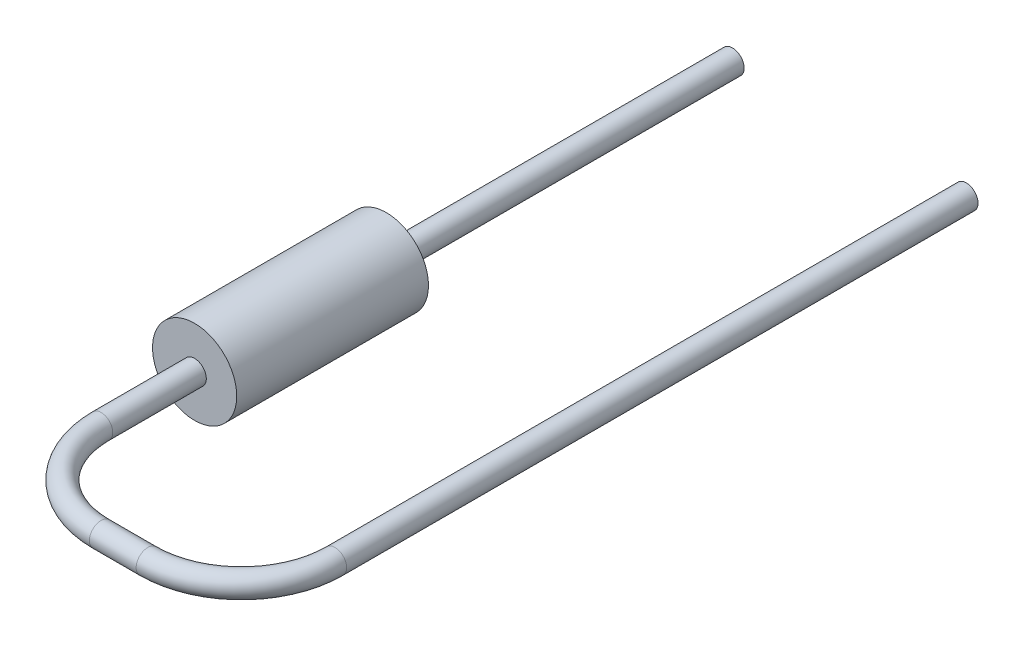
ISO-10303-21;
HEADER;
FILE_DESCRIPTION(('STEP AP214'),'2;1');
FILE_NAME('part.step','',(''),(''),'','','');
FILE_SCHEMA(('AUTOMOTIVE_DESIGN { 1 0 10303 214 1 1 1 1 }'));
ENDSEC;
DATA;
#1=APPLICATION_CONTEXT('core data for automotive mechanical design processes');
#2=APPLICATION_PROTOCOL_DEFINITION('international standard','automotive_design',2000,#1);
#3=PRODUCT_CONTEXT('',#1,'mechanical');
#4=PRODUCT('Part','Part','',(#3));
#5=PRODUCT_RELATED_PRODUCT_CATEGORY('part','',(#4));
#6=PRODUCT_DEFINITION_FORMATION('','',#4);
#7=PRODUCT_DEFINITION_CONTEXT('part definition',#1,'design');
#8=PRODUCT_DEFINITION('design','',#6,#7);
#9=PRODUCT_DEFINITION_SHAPE('','',#8);
#10=(LENGTH_UNIT() NAMED_UNIT(*) SI_UNIT(.MILLI.,.METRE.));
#11=(NAMED_UNIT(*) PLANE_ANGLE_UNIT() SI_UNIT($,.RADIAN.));
#12=(NAMED_UNIT(*) SI_UNIT($,.STERADIAN.) SOLID_ANGLE_UNIT());
#13=UNCERTAINTY_MEASURE_WITH_UNIT(LENGTH_MEASURE(1.E-05),#10,'distance_accuracy_value','');
#14=(GEOMETRIC_REPRESENTATION_CONTEXT(3) GLOBAL_UNCERTAINTY_ASSIGNED_CONTEXT((#13)) GLOBAL_UNIT_ASSIGNED_CONTEXT((#10,
#11,#12)) REPRESENTATION_CONTEXT('',''));
#15=CARTESIAN_POINT('',(0.,0.,0.));
#16=DIRECTION('',(0.,0.,1.));
#17=DIRECTION('',(1.,0.,0.));
#18=AXIS2_PLACEMENT_3D('',#15,#16,#17);
#19=CARTESIAN_POINT('',(0.,0.,4.1));
#20=DIRECTION('',(0.,0.,-1.));
#21=DIRECTION('',(-1.,0.,0.));
#22=AXIS2_PLACEMENT_3D('',#19,#20,#21);
#23=CYLINDRICAL_SURFACE('',#22,0.9);
#24=CARTESIAN_POINT('',(0.,0.,4.1));
#25=DIRECTION('',(0.,0.,1.));
#26=DIRECTION('',(1.,0.,0.));
#27=AXIS2_PLACEMENT_3D('',#24,#25,#26);
#28=CIRCLE('',#27,0.9);
#29=CARTESIAN_POINT('',(0.9,0.,4.1));
#30=VERTEX_POINT('',#29);
#31=EDGE_CURVE('E38',#30,#30,#28,.T.);
#32=ORIENTED_EDGE('',*,*,#31,.F.);
#33=EDGE_LOOP('',(#32));
#34=FACE_BOUND('',#33,.T.);
#35=CARTESIAN_POINT('',(0.,0.,0.));
#36=DIRECTION('',(0.,0.,1.));
#37=DIRECTION('',(1.,0.,0.));
#38=AXIS2_PLACEMENT_3D('',#35,#36,#37);
#39=CIRCLE('',#38,0.9);
#40=CARTESIAN_POINT('',(0.9,0.,0.));
#41=VERTEX_POINT('',#40);
#42=EDGE_CURVE('E34',#41,#41,#39,.T.);
#43=ORIENTED_EDGE('',*,*,#42,.T.);
#44=EDGE_LOOP('',(#43));
#45=FACE_BOUND('',#44,.T.);
#46=ADVANCED_FACE('F31',(#34,#45),#23,.T.);
#47=CARTESIAN_POINT('',(0.,0.,4.1));
#48=DIRECTION('',(0.,0.,1.));
#49=DIRECTION('',(1.,0.,0.));
#50=AXIS2_PLACEMENT_3D('',#47,#48,#49);
#51=PLANE('',#50);
#52=CARTESIAN_POINT('',(0.,0.,4.1));
#53=DIRECTION('',(0.,0.,1.));
#54=DIRECTION('',(1.,0.,0.));
#55=AXIS2_PLACEMENT_3D('',#52,#53,#54);
#56=CIRCLE('',#55,0.25);
#57=CARTESIAN_POINT('',(0.25,0.,4.1));
#58=VERTEX_POINT('',#57);
#59=EDGE_CURVE('E10',#58,#58,#56,.T.);
#60=ORIENTED_EDGE('',*,*,#59,.F.);
#61=EDGE_LOOP('',(#60));
#62=FACE_BOUND('',#61,.T.);
#63=ORIENTED_EDGE('',*,*,#31,.T.);
#64=EDGE_LOOP('',(#63));
#65=FACE_BOUND('',#64,.T.);
#66=ADVANCED_FACE('F67',(#62,#65),#51,.T.);
#67=CARTESIAN_POINT('',(0.,0.,0.));
#68=DIRECTION('',(0.,0.,1.));
#69=DIRECTION('',(1.,0.,0.));
#70=AXIS2_PLACEMENT_3D('',#67,#68,#69);
#71=PLANE('',#70);
#72=CARTESIAN_POINT('',(0.,0.,0.));
#73=DIRECTION('',(0.,0.,1.));
#74=DIRECTION('',(1.,0.,0.));
#75=AXIS2_PLACEMENT_3D('',#72,#73,#74);
#76=CIRCLE('',#75,0.25);
#77=CARTESIAN_POINT('',(0.25,0.,0.));
#78=VERTEX_POINT('',#77);
#79=EDGE_CURVE('E186',#78,#78,#76,.T.);
#80=ORIENTED_EDGE('',*,*,#79,.T.);
#81=EDGE_LOOP('',(#80));
#82=FACE_BOUND('',#81,.T.);
#83=ORIENTED_EDGE('',*,*,#42,.F.);
#84=EDGE_LOOP('',(#83));
#85=FACE_BOUND('',#84,.T.);
#86=ADVANCED_FACE('F64',(#82,#85),#71,.F.);
#87=CARTESIAN_POINT('',(5.,0.,6.09999999999998));
#88=DIRECTION('',(0.,0.,-1.));
#89=DIRECTION('',(-1.,0.,0.));
#90=AXIS2_PLACEMENT_3D('',#87,#88,#89);
#91=CYLINDRICAL_SURFACE('',#90,0.25);
#92=CARTESIAN_POINT('',(5.,0.,6.09999999999998));
#93=DIRECTION('',(0.,0.,-1.));
#94=DIRECTION('',(-1.,0.,0.));
#95=AXIS2_PLACEMENT_3D('',#92,#93,#94);
#96=CIRCLE('',#95,0.25);
#97=CARTESIAN_POINT('',(5.25,0.,6.09999999999998));
#98=VERTEX_POINT('',#97);
#99=EDGE_CURVE('E53',#98,#98,#96,.T.);
#100=ORIENTED_EDGE('',*,*,#99,.T.);
#101=EDGE_LOOP('',(#100));
#102=FACE_BOUND('',#101,.T.);
#103=CARTESIAN_POINT('',(5.,0.,-7.4));
#104=DIRECTION('',(0.,0.,-1.));
#105=DIRECTION('',(-1.,0.,0.));
#106=AXIS2_PLACEMENT_3D('',#103,#104,#105);
#107=CIRCLE('',#106,0.25);
#108=CARTESIAN_POINT('',(4.75,0.,-7.39999999999999));
#109=VERTEX_POINT('',#108);
#110=EDGE_CURVE('E56',#109,#109,#107,.T.);
#111=ORIENTED_EDGE('',*,*,#110,.F.);
#112=EDGE_LOOP('',(#111));
#113=FACE_BOUND('',#112,.T.);
#114=ADVANCED_FACE('F66',(#102,#113),#91,.T.);
#115=CARTESIAN_POINT('',(3.,0.,6.1));
#116=DIRECTION('',(0.,1.,0.));
#117=DIRECTION('',(0.,0.,1.));
#118=AXIS2_PLACEMENT_3D('',#115,#116,#117);
#119=TOROIDAL_SURFACE('',#118,2.,0.25);
#120=CARTESIAN_POINT('',(2.99999999999999,0.,8.1));
#121=DIRECTION('',(1.,0.,0.));
#122=DIRECTION('',(0.,0.,-1.));
#123=AXIS2_PLACEMENT_3D('',#120,#121,#122);
#124=CIRCLE('',#123,0.25);
#125=CARTESIAN_POINT('',(2.99999999999999,0.,8.35));
#126=VERTEX_POINT('',#125);
#127=EDGE_CURVE('E50',#126,#126,#124,.T.);
#128=CARTESIAN_POINT('',(3.,0.,6.1));
#129=DIRECTION('',(0.,1.,0.));
#130=DIRECTION('',(0.,0.,1.));
#131=AXIS2_PLACEMENT_3D('',#128,#129,#130);
#132=CIRCLE('',#131,2.25);
#133=EDGE_CURVE('',#126,#98,#132,.T.);
#134=ORIENTED_EDGE('',*,*,#127,.T.);
#135=ORIENTED_EDGE('',*,*,#99,.F.);
#136=ORIENTED_EDGE('',*,*,#133,.T.);
#137=ORIENTED_EDGE('',*,*,#133,.F.);
#138=EDGE_LOOP('',(#134,#136,#135,#137));
#139=FACE_BOUND('',#138,.T.);
#140=ADVANCED_FACE('F73',(#139),#119,.T.);
#141=CARTESIAN_POINT('',(2.00000000000001,0.,8.1));
#142=DIRECTION('',(1.,0.,0.));
#143=DIRECTION('',(0.,0.,-1.));
#144=AXIS2_PLACEMENT_3D('',#141,#142,#143);
#145=CYLINDRICAL_SURFACE('',#144,0.25);
#146=CARTESIAN_POINT('',(2.00000000000001,0.,8.1));
#147=DIRECTION('',(1.,0.,0.));
#148=DIRECTION('',(0.,0.,-1.));
#149=AXIS2_PLACEMENT_3D('',#146,#147,#148);
#150=CIRCLE('',#149,0.25);
#151=CARTESIAN_POINT('',(2.00000000000002,0.,8.35));
#152=VERTEX_POINT('',#151);
#153=EDGE_CURVE('E47',#152,#152,#150,.T.);
#154=ORIENTED_EDGE('',*,*,#153,.T.);
#155=EDGE_LOOP('',(#154));
#156=FACE_BOUND('',#155,.T.);
#157=ORIENTED_EDGE('',*,*,#127,.F.);
#158=EDGE_LOOP('',(#157));
#159=FACE_BOUND('',#158,.T.);
#160=ADVANCED_FACE('F138',(#156,#159),#145,.T.);
#161=CARTESIAN_POINT('',(2.,0.,6.1));
#162=DIRECTION('',(0.,1.,0.));
#163=DIRECTION('',(0.,0.,1.));
#164=AXIS2_PLACEMENT_3D('',#161,#162,#163);
#165=TOROIDAL_SURFACE('',#164,2.,0.25);
#166=CARTESIAN_POINT('',(0.,0.,6.09999999999999));
#167=DIRECTION('',(0.,0.,1.));
#168=DIRECTION('',(1.,0.,0.));
#169=AXIS2_PLACEMENT_3D('',#166,#167,#168);
#170=CIRCLE('',#169,0.25);
#171=CARTESIAN_POINT('',(-0.25,0.,6.09999999999998));
#172=VERTEX_POINT('',#171);
#173=EDGE_CURVE('E45',#172,#172,#170,.T.);
#174=CARTESIAN_POINT('',(2.,0.,6.1));
#175=DIRECTION('',(0.,1.,0.));
#176=DIRECTION('',(0.,0.,1.));
#177=AXIS2_PLACEMENT_3D('',#174,#175,#176);
#178=CIRCLE('',#177,2.25);
#179=EDGE_CURVE('',#172,#152,#178,.T.);
#180=ORIENTED_EDGE('',*,*,#173,.T.);
#181=ORIENTED_EDGE('',*,*,#153,.F.);
#182=ORIENTED_EDGE('',*,*,#179,.T.);
#183=ORIENTED_EDGE('',*,*,#179,.F.);
#184=EDGE_LOOP('',(#180,#182,#181,#183));
#185=FACE_BOUND('',#184,.T.);
#186=ADVANCED_FACE('F134',(#185),#165,.T.);
#187=CARTESIAN_POINT('',(0.,0.,6.09999999999999));
#188=DIRECTION('',(0.,0.,-1.));
#189=DIRECTION('',(-1.,0.,0.));
#190=AXIS2_PLACEMENT_3D('',#187,#188,#189);
#191=CYLINDRICAL_SURFACE('',#190,0.25);
#192=ORIENTED_EDGE('',*,*,#173,.F.);
#193=EDGE_LOOP('',(#192));
#194=FACE_BOUND('',#193,.T.);
#195=ORIENTED_EDGE('',*,*,#59,.T.);
#196=EDGE_LOOP('',(#195));
#197=FACE_BOUND('',#196,.T.);
#198=ADVANCED_FACE('F131',(#194,#197),#191,.T.);
#199=CARTESIAN_POINT('',(5.,0.,-7.4));
#200=DIRECTION('',(0.,0.,-1.));
#201=DIRECTION('',(-1.,0.,0.));
#202=AXIS2_PLACEMENT_3D('',#199,#200,#201);
#203=PLANE('',#202);
#204=ORIENTED_EDGE('',*,*,#110,.T.);
#205=EDGE_LOOP('',(#204));
#206=FACE_BOUND('',#205,.T.);
#207=ADVANCED_FACE('F103',(#206),#203,.T.);
#208=CARTESIAN_POINT('',(5.,0.,-7.4));
#209=DIRECTION('',(0.,0.,-1.));
#210=DIRECTION('',(-1.,0.,0.));
#211=AXIS2_PLACEMENT_3D('',#208,#209,#210);
#212=PLANE('',#211);
#213=CARTESIAN_POINT('',(0.,0.,-7.39999999999986));
#214=DIRECTION('',(0.,0.,-1.));
#215=DIRECTION('',(-1.,0.,0.));
#216=AXIS2_PLACEMENT_3D('',#213,#214,#215);
#217=CIRCLE('',#216,0.25);
#218=CARTESIAN_POINT('',(-0.25,0.,-7.39999999999985));
#219=VERTEX_POINT('',#218);
#220=EDGE_CURVE('E184',#219,#219,#217,.F.);
#221=ORIENTED_EDGE('',*,*,#220,.F.);
#222=EDGE_LOOP('',(#221));
#223=FACE_BOUND('',#222,.T.);
#224=ADVANCED_FACE('F108',(#223),#212,.T.);
#225=CARTESIAN_POINT('',(0.,0.,-8.10710678118641));
#226=DIRECTION('',(0.,0.,1.));
#227=DIRECTION('',(1.,0.,0.));
#228=AXIS2_PLACEMENT_3D('',#225,#226,#227);
#229=CYLINDRICAL_SURFACE('',#228,0.25);
#230=ORIENTED_EDGE('',*,*,#79,.F.);
#231=EDGE_LOOP('',(#230));
#232=FACE_BOUND('',#231,.T.);
#233=ORIENTED_EDGE('',*,*,#220,.T.);
#234=EDGE_LOOP('',(#233));
#235=FACE_BOUND('',#234,.T.);
#236=ADVANCED_FACE('F113',(#232,#235),#229,.T.);
#237=CLOSED_SHELL('',(#46,#66,#86,#114,#140,#160,#186,#198,#207,#224,#236));
#238=MANIFOLD_SOLID_BREP('B2',#237);
#239=ADVANCED_BREP_SHAPE_REPRESENTATION('',(#18,#238),#14);
#240=SHAPE_DEFINITION_REPRESENTATION(#9,#239);
ENDSEC;
END-ISO-10303-21;
